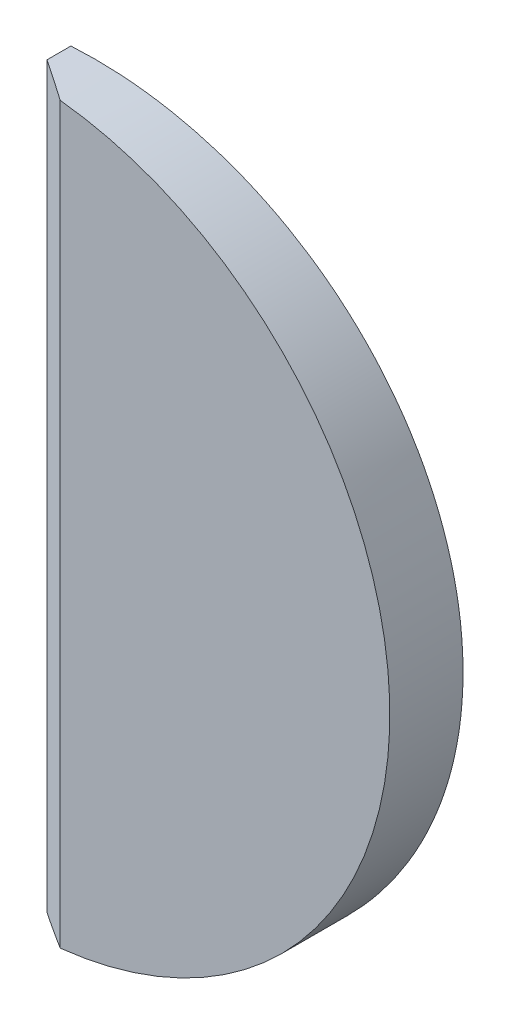
ISO-10303-21;
HEADER;
FILE_DESCRIPTION(('STEP AP214'),'2;1');
FILE_NAME('part.step','',(''),(''),'','','');
FILE_SCHEMA(('AUTOMOTIVE_DESIGN { 1 0 10303 214 1 1 1 1 }'));
ENDSEC;
DATA;
#1=APPLICATION_CONTEXT('core data for automotive mechanical design processes');
#2=APPLICATION_PROTOCOL_DEFINITION('international standard','automotive_design',2000,#1);
#3=PRODUCT_CONTEXT('',#1,'mechanical');
#4=PRODUCT('Part','Part','',(#3));
#5=PRODUCT_RELATED_PRODUCT_CATEGORY('part','',(#4));
#6=PRODUCT_DEFINITION_FORMATION('','',#4);
#7=PRODUCT_DEFINITION_CONTEXT('part definition',#1,'design');
#8=PRODUCT_DEFINITION('design','',#6,#7);
#9=PRODUCT_DEFINITION_SHAPE('','',#8);
#10=(LENGTH_UNIT() NAMED_UNIT(*) SI_UNIT(.MILLI.,.METRE.));
#11=(NAMED_UNIT(*) PLANE_ANGLE_UNIT() SI_UNIT($,.RADIAN.));
#12=(NAMED_UNIT(*) SI_UNIT($,.STERADIAN.) SOLID_ANGLE_UNIT());
#13=UNCERTAINTY_MEASURE_WITH_UNIT(LENGTH_MEASURE(1.E-05),#10,'distance_accuracy_value','');
#14=(GEOMETRIC_REPRESENTATION_CONTEXT(3) GLOBAL_UNCERTAINTY_ASSIGNED_CONTEXT((#13)) GLOBAL_UNIT_ASSIGNED_CONTEXT((#10,
#11,#12)) REPRESENTATION_CONTEXT('',''));
#15=CARTESIAN_POINT('',(0.,0.,0.));
#16=DIRECTION('',(0.,0.,1.));
#17=DIRECTION('',(1.,0.,0.));
#18=AXIS2_PLACEMENT_3D('',#15,#16,#17);
#19=CARTESIAN_POINT('',(0.,0.,4.));
#20=DIRECTION('',(0.,0.,1.));
#21=DIRECTION('',(1.,0.,0.));
#22=AXIS2_PLACEMENT_3D('',#19,#20,#21);
#23=PLANE('',#22);
#24=CARTESIAN_POINT('',(-3.,0.,4.));
#25=DIRECTION('',(0.,0.,1.));
#26=DIRECTION('',(1.,0.,0.));
#27=AXIS2_PLACEMENT_3D('',#24,#25,#26);
#28=CIRCLE('',#27,14.);
#29=CARTESIAN_POINT('',(-1.49999999999999,13.9194109070751,4.));
#30=VERTEX_POINT('',#29);
#31=CARTESIAN_POINT('',(-1.49999999999999,-13.9194109070751,4.));
#32=VERTEX_POINT('',#31);
#33=EDGE_CURVE('E74',#30,#32,#28,.F.);
#34=ORIENTED_EDGE('',*,*,#33,.F.);
#35=DIRECTION('',(0.,-1.,0.));
#36=VECTOR('',#35,1.);
#37=CARTESIAN_POINT('',(-1.49999999999999,0.,4.));
#38=LINE('',#37,#36);
#39=EDGE_CURVE('E77',#30,#32,#38,.T.);
#40=ORIENTED_EDGE('',*,*,#39,.T.);
#41=EDGE_LOOP('',(#34,#40));
#42=FACE_BOUND('',#41,.T.);
#43=ADVANCED_FACE('F32',(#42),#23,.T.);
#44=CARTESIAN_POINT('',(-3.,-33.1414213562373,0.));
#45=DIRECTION('',(-1.,0.,0.));
#46=DIRECTION('',(0.,0.,1.));
#47=AXIS2_PLACEMENT_3D('',#44,#45,#46);
#48=PLANE('',#47);
#49=DIRECTION('',(0.,0.,1.));
#50=VECTOR('',#49,1.);
#51=CARTESIAN_POINT('',(-3.,-14.,0.));
#52=LINE('',#51,#50);
#53=CARTESIAN_POINT('',(-3.,-14.,2.09384173198607));
#54=VERTEX_POINT('',#53);
#55=CARTESIAN_POINT('',(-3.,-14.,3.));
#56=VERTEX_POINT('',#55);
#57=EDGE_CURVE('E67',#54,#56,#52,.T.);
#58=ORIENTED_EDGE('',*,*,#57,.T.);
#59=DIRECTION('',(0.,1.,0.));
#60=VECTOR('',#59,1.);
#61=CARTESIAN_POINT('',(-3.,-33.1414213562373,3.));
#62=LINE('',#61,#60);
#63=CARTESIAN_POINT('',(-3.,14.,3.));
#64=VERTEX_POINT('',#63);
#65=EDGE_CURVE('E11',#56,#64,#62,.T.);
#66=ORIENTED_EDGE('',*,*,#65,.T.);
#67=DIRECTION('',(0.,0.,1.));
#68=VECTOR('',#67,1.);
#69=CARTESIAN_POINT('',(-3.,14.,0.));
#70=LINE('',#69,#68);
#71=CARTESIAN_POINT('',(-3.,14.,2.09384173198607));
#72=VERTEX_POINT('',#71);
#73=EDGE_CURVE('E65',#72,#64,#70,.T.);
#74=ORIENTED_EDGE('',*,*,#73,.F.);
#75=CARTESIAN_POINT('',(-3.,0.,50.));
#76=DIRECTION('',(-1.,0.,0.));
#77=DIRECTION('',(0.,0.,1.));
#78=AXIS2_PLACEMENT_3D('',#75,#76,#77);
#79=CIRCLE('',#78,49.9099188538711);
#80=EDGE_CURVE('E71',#54,#72,#79,.F.);
#81=ORIENTED_EDGE('',*,*,#80,.F.);
#82=EDGE_LOOP('',(#58,#66,#74,#81));
#83=FACE_BOUND('',#82,.T.);
#84=ADVANCED_FACE('F73',(#83),#48,.T.);
#85=CARTESIAN_POINT('',(-3.,0.,0.));
#86=DIRECTION('',(0.,0.,1.));
#87=DIRECTION('',(1.,0.,0.));
#88=AXIS2_PLACEMENT_3D('',#85,#86,#87);
#89=CYLINDRICAL_SURFACE('',#88,14.);
#90=ORIENTED_EDGE('',*,*,#33,.T.);
#91=CARTESIAN_POINT('',(-3.,0.,3.));
#92=DIRECTION('',(0.554700196225226,0.,-0.832050294337845));
#93=DIRECTION('',(0.832050294337846,0.,0.554700196225226));
#94=AXIS2_PLACEMENT_3D('',#91,#92,#93);
#95=ELLIPSE('',#94,16.8259059521652,14.);
#96=EDGE_CURVE('E40',#32,#56,#95,.T.);
#97=ORIENTED_EDGE('',*,*,#96,.T.);
#98=ORIENTED_EDGE('',*,*,#57,.F.);
#99=CARTESIAN_POINT('',(-3.0002,-13.9999999985714,2.09385425647353));
#100=CARTESIAN_POINT('',(-2.60590222227501,-14.0000475680015,2.06916217451614));
#101=CARTESIAN_POINT('',(-2.21160874463055,-13.9833554384607,2.04448982660385));
#102=CARTESIAN_POINT('',(-1.42583529223525,-13.9167938326264,1.99535869443073));
#103=CARTESIAN_POINT('',(-1.03435519532508,-13.8669258057639,1.97089990088714));
#104=CARTESIAN_POINT('',(-0.257229608206576,-13.734357249443,1.92238346413396));
#105=CARTESIAN_POINT('',(0.128419488423257,-13.6516779545213,1.89832557194416));
#106=CARTESIAN_POINT('',(0.891397604352164,-13.4540809904812,1.85076375619962));
#107=CARTESIAN_POINT('',(1.26872673161907,-13.3391637399791,1.82725982545586));
#108=CARTESIAN_POINT('',(2.01256972640206,-13.0778295806415,1.78095858764466));
#109=CARTESIAN_POINT('',(2.37907816539312,-12.9313971566792,1.75816163497445));
#110=CARTESIAN_POINT('',(3.09847235289312,-12.6080984158686,1.71344561833759));
#111=CARTESIAN_POINT('',(3.45135811513056,-12.4312321296916,1.69152655348622));
#112=CARTESIAN_POINT('',(4.14091630333996,-12.0483527552606,1.64872332775116));
#113=CARTESIAN_POINT('',(4.47759208575134,-11.8423457359796,1.62783895259834));
#114=CARTESIAN_POINT('',(5.13240059061706,-11.4026134733572,1.58724532123565));
#115=CARTESIAN_POINT('',(5.45053341291759,-11.1688883792866,1.56753605869827));
#116=CARTESIAN_POINT('',(6.065711653893,-10.6755882424384,1.52944571791589));
#117=CARTESIAN_POINT('',(6.36277518869218,-10.4160358799324,1.51106349838305));
#118=CARTESIAN_POINT('',(6.93399223967929,-9.8727483817069,1.47573529093935));
#119=CARTESIAN_POINT('',(7.2081457240319,-9.58901321238466,1.45878930502424));
#120=CARTESIAN_POINT('',(7.73161358738709,-8.99932937062192,1.42644811045715));
#121=CARTESIAN_POINT('',(7.98092429284915,-8.69337742448119,1.41105313115122));
#122=CARTESIAN_POINT('',(8.45286745588252,-8.06147225477707,1.38192294059414));
#123=CARTESIAN_POINT('',(8.67549996065857,-7.73551906660569,1.36818772640619));
#124=CARTESIAN_POINT('',(9.09209281497664,-7.06655964533632,1.34249573108795));
#125=CARTESIAN_POINT('',(9.28610603665429,-6.7235864633963,1.33053567022611));
#126=CARTESIAN_POINT('',(9.64456179532339,-6.02246396219025,1.30844536434306));
#127=CARTESIAN_POINT('',(9.8090043638549,-5.66431465911158,1.29831511737018));
#128=CARTESIAN_POINT('',(10.1071241570131,-4.93541564361964,1.27995454360123));
#129=CARTESIAN_POINT('',(10.2408035979703,-4.56466684114778,1.27172407993508));
#130=CARTESIAN_POINT('',(10.4764486642977,-3.81318679533553,1.25721853813917));
#131=CARTESIAN_POINT('',(10.5784143224123,-3.43245556230243,1.25094345799047));
#132=CARTESIAN_POINT('',(10.7497545150031,-2.66436233026161,1.24040038242056));
#133=CARTESIAN_POINT('',(10.8191825931808,-2.27701231979526,1.2361290895637));
#134=CARTESIAN_POINT('',(10.9251967866053,-1.4978271245387,1.22960743056622));
#135=CARTESIAN_POINT('',(10.9617829389068,-1.10599194480953,1.22735706214543));
#136=CARTESIAN_POINT('',(11.0018502336274,-0.32061935193398,1.22489258926677));
#137=CARTESIAN_POINT('',(11.0053307919662,0.0729180911227803,1.22467852073524));
#138=CARTESIAN_POINT('',(10.9791603041064,0.858885586608105,1.22628820288487));
#139=CARTESIAN_POINT('',(10.9495092661697,1.2513156393128,1.22811195305787));
#140=CARTESIAN_POINT('',(10.8573272803849,2.03195123652065,1.23378247502376));
#141=CARTESIAN_POINT('',(10.7948234841701,2.42015999974568,1.2376275762425));
#142=CARTESIAN_POINT('',(10.6374015091007,3.18992305833566,1.24731358707044));
#143=CARTESIAN_POINT('',(10.5424833541993,3.57147735861783,1.25315449520479));
#144=CARTESIAN_POINT('',(10.32091473891,4.32522086856132,1.2667922779052));
#145=CARTESIAN_POINT('',(10.1942643936945,4.69741011220784,1.27458914537207));
#146=CARTESIAN_POINT('',(9.91013985763604,5.42978489347444,1.29208569829717));
#147=CARTESIAN_POINT('',(9.75266565136066,5.78997042508457,1.30178538470808));
#148=CARTESIAN_POINT('',(9.40795216280897,6.4959284526713,1.32302571293344));
#149=CARTESIAN_POINT('',(9.22070088759626,6.84169507019443,1.33456709651168));
#150=CARTESIAN_POINT('',(8.81781976723072,7.51621302003435,1.35940920576884));
#151=CARTESIAN_POINT('',(8.6021899106028,7.84496434547081,1.37270993215916));
#152=CARTESIAN_POINT('',(8.14410342636149,8.48311390731424,1.40097922533495));
#153=CARTESIAN_POINT('',(7.90164799117946,8.79251300299642,1.41594771798629));
#154=CARTESIAN_POINT('',(7.39163304426742,9.38979110691985,1.44745067155597));
#155=CARTESIAN_POINT('',(7.12407355167576,9.67767013156688,1.46398513128047));
#156=CARTESIAN_POINT('',(6.56539936541629,10.2302342407541,1.49852894186052));
#157=CARTESIAN_POINT('',(6.27425505129305,10.4948892614723,1.51654014773439));
#158=CARTESIAN_POINT('',(5.67078123710792,10.9987300849289,1.55389555187595));
#159=CARTESIAN_POINT('',(5.35845156212998,11.2379156773382,1.57323976114956));
#160=CARTESIAN_POINT('',(4.71472255985674,11.6892096039049,1.61313470250362));
#161=CARTESIAN_POINT('',(4.38331685306463,11.9013088024789,1.63368583825727));
#162=CARTESIAN_POINT('',(3.7038963483117,12.2968403874717,1.67584638739566));
#163=CARTESIAN_POINT('',(3.35588203462716,12.4802736090716,1.69745576992435));
#164=CARTESIAN_POINT('',(2.6448208159025,12.8176142880666,1.74163892047821));
#165=CARTESIAN_POINT('',(2.28173868558814,12.9714471992058,1.76421495274075));
#166=CARTESIAN_POINT('',(1.54393769924115,13.2479365384159,1.8101239571847));
#167=CARTESIAN_POINT('',(1.16921889311931,13.3705931001842,1.83345692611956));
#168=CARTESIAN_POINT('',(0.411303254909583,13.583732789547,1.8806860346601));
#169=CARTESIAN_POINT('',(0.0281178405901764,13.6742567359486,1.90458141834974));
#170=CARTESIAN_POINT('',(-0.74433687879949,13.8226823450493,1.95278822673807));
#171=CARTESIAN_POINT('',(-1.13360311627084,13.8805999431774,1.97709944221429));
#172=CARTESIAN_POINT('',(-1.76979241845547,13.9480267065734,2.01686253814163));
#173=CARTESIAN_POINT('',(-2.01570392349407,13.9675323404644,2.0322398551164));
#174=CARTESIAN_POINT('',(-2.50780200586525,13.9935113701955,2.06302653466647));
#175=CARTESIAN_POINT('',(-2.7539874519111,14.0000063105297,2.07843580189825));
#176=CARTESIAN_POINT('',(-3.0002,13.9999999985714,2.09385425647353));
#177=B_SPLINE_CURVE_WITH_KNOTS('',3,(#99,#100,#101,#102,#103,#104,#105,#106,#107,#108,#109,#110,
#111,#112,#113,#114,#115,#116,#117,#118,#119,#120,#121,#122,#123,#124,#125,#126,#127,#128,#129,
#130,#131,#132,#133,#134,#135,#136,#137,#138,#139,#140,#141,#142,#143,#144,#145,#146,#147,#148,
#149,#150,#151,#152,#153,#154,#155,#156,#157,#158,#159,#160,#161,#162,#163,#164,#165,#166,#167,
#168,#169,#170,#171,#172,#173,#174,#175,#176),.UNSPECIFIED.,.F.,.F.,(4,2,2,2,2,2,2,2,2,2,2,2,2,
2,2,2,2,2,2,2,2,2,2,2,2,2,2,2,2,2,2,2,2,2,2,2,2,2,4),(0.,1.18484971123611,2.36964766064174,
3.55368008905713,4.73769714328772,5.92229843571816,7.10689853431326,8.29125228528742,
9.47559965841672,10.6589160219148,11.8422340296974,13.0257267577036,14.2092173915917,
15.3904934641229,16.5717682766971,17.7529579576293,18.934146418981,20.1133842366702,
21.2926207238467,22.4718780161905,23.6511350144618,24.8294189277984,26.0077019704211,
27.1859807365126,28.3642600925285,29.5430152168999,30.7217708179116,31.9004740427609,
33.0791763690202,34.2593827015553,35.4395987796012,36.6202118704804,37.8007905578715,
38.984304611966,40.167813590559,41.3498137039626,42.531235645699,43.2724078131475,
44.0123516507693),.UNSPECIFIED.);
#178=EDGE_CURVE('E63',#54,#72,#177,.T.);
#179=ORIENTED_EDGE('',*,*,#178,.T.);
#180=ORIENTED_EDGE('',*,*,#73,.T.);
#181=CARTESIAN_POINT('',(-3.,0.,3.));
#182=DIRECTION('',(0.554700196225226,0.,-0.832050294337845));
#183=DIRECTION('',(0.832050294337846,0.,0.554700196225226));
#184=AXIS2_PLACEMENT_3D('',#181,#182,#183);
#185=ELLIPSE('',#184,16.8259059521652,14.);
#186=EDGE_CURVE('E80',#64,#30,#185,.T.);
#187=ORIENTED_EDGE('',*,*,#186,.T.);
#188=EDGE_LOOP('',(#90,#97,#98,#179,#180,#187));
#189=FACE_BOUND('',#188,.T.);
#190=ADVANCED_FACE('F64',(#189),#89,.T.);
#191=CARTESIAN_POINT('',(0.,0.,50.));
#192=DIRECTION('',(0.,0.,-1.));
#193=DIRECTION('',(0.,-1.,0.));
#194=AXIS2_PLACEMENT_3D('',#191,#192,#193);
#195=SPHERICAL_SURFACE('',#194,50.);
#196=ORIENTED_EDGE('',*,*,#178,.F.);
#197=ORIENTED_EDGE('',*,*,#80,.T.);
#198=EDGE_LOOP('',(#196,#197));
#199=FACE_BOUND('',#198,.T.);
#200=ADVANCED_FACE('F76',(#199),#195,.T.);
#201=CARTESIAN_POINT('',(-1.49999999999999,0.,4.));
#202=DIRECTION('',(0.554700196225226,0.,-0.832050294337845));
#203=DIRECTION('',(-0.832050294337846,0.,-0.554700196225226));
#204=AXIS2_PLACEMENT_3D('',#201,#202,#203);
#205=PLANE('',#204);
#206=ORIENTED_EDGE('',*,*,#186,.F.);
#207=ORIENTED_EDGE('',*,*,#65,.F.);
#208=ORIENTED_EDGE('',*,*,#96,.F.);
#209=ORIENTED_EDGE('',*,*,#39,.F.);
#210=EDGE_LOOP('',(#206,#207,#208,#209));
#211=FACE_BOUND('',#210,.T.);
#212=ADVANCED_FACE('F34',(#211),#205,.F.);
#213=CLOSED_SHELL('',(#43,#84,#190,#200,#212));
#214=MANIFOLD_SOLID_BREP('B2',#213);
#215=ADVANCED_BREP_SHAPE_REPRESENTATION('',(#18,#214),#14);
#216=SHAPE_DEFINITION_REPRESENTATION(#9,#215);
ENDSEC;
END-ISO-10303-21;
